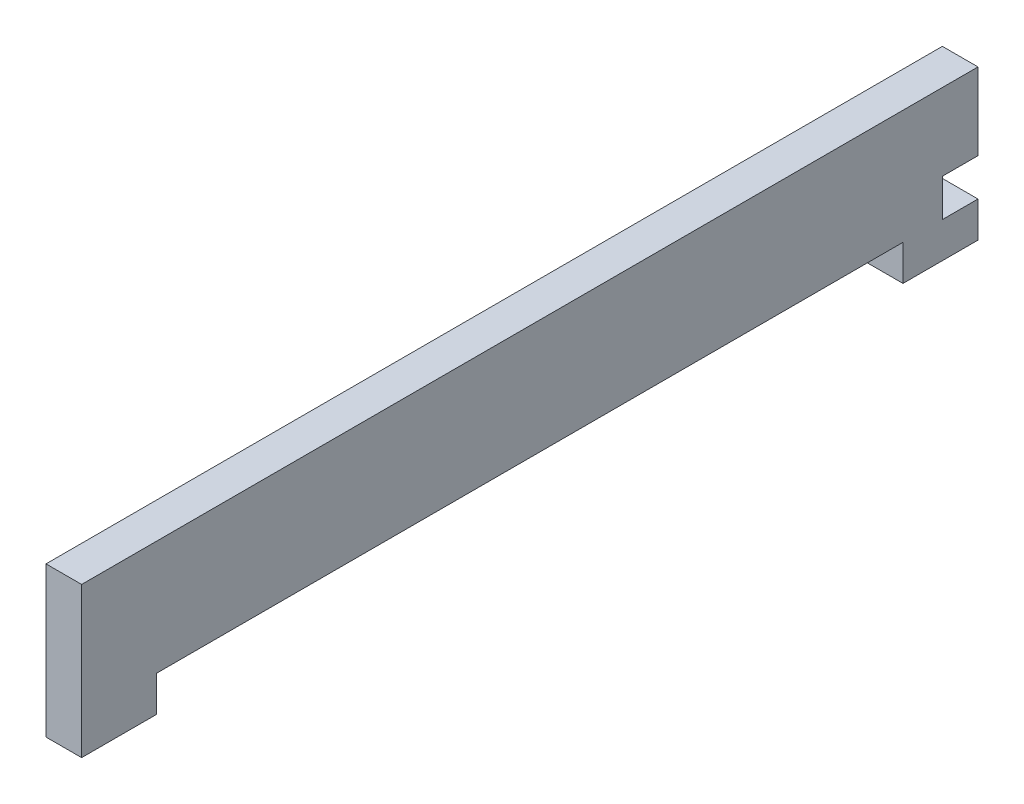
ISO-10303-21;
HEADER;
FILE_DESCRIPTION(('STEP AP214'),'2;1');
FILE_NAME('part.step','',(''),(''),'','','');
FILE_SCHEMA(('AUTOMOTIVE_DESIGN { 1 0 10303 214 1 1 1 1 }'));
ENDSEC;
DATA;
#1=APPLICATION_CONTEXT('core data for automotive mechanical design processes');
#2=APPLICATION_PROTOCOL_DEFINITION('international standard','automotive_design',2000,#1);
#3=PRODUCT_CONTEXT('',#1,'mechanical');
#4=PRODUCT('Part','Part','',(#3));
#5=PRODUCT_RELATED_PRODUCT_CATEGORY('part','',(#4));
#6=PRODUCT_DEFINITION_FORMATION('','',#4);
#7=PRODUCT_DEFINITION_CONTEXT('part definition',#1,'design');
#8=PRODUCT_DEFINITION('design','',#6,#7);
#9=PRODUCT_DEFINITION_SHAPE('','',#8);
#10=(LENGTH_UNIT() NAMED_UNIT(*) SI_UNIT(.MILLI.,.METRE.));
#11=(NAMED_UNIT(*) PLANE_ANGLE_UNIT() SI_UNIT($,.RADIAN.));
#12=(NAMED_UNIT(*) SI_UNIT($,.STERADIAN.) SOLID_ANGLE_UNIT());
#13=UNCERTAINTY_MEASURE_WITH_UNIT(LENGTH_MEASURE(1.E-05),#10,'distance_accuracy_value','');
#14=(GEOMETRIC_REPRESENTATION_CONTEXT(3) GLOBAL_UNCERTAINTY_ASSIGNED_CONTEXT((#13)) GLOBAL_UNIT_ASSIGNED_CONTEXT((#10,
#11,#12)) REPRESENTATION_CONTEXT('',''));
#15=CARTESIAN_POINT('',(0.,0.,0.));
#16=DIRECTION('',(0.,0.,1.));
#17=DIRECTION('',(1.,0.,0.));
#18=AXIS2_PLACEMENT_3D('',#15,#16,#17);
#19=CARTESIAN_POINT('',(4.75,0.,-119.5));
#20=DIRECTION('',(0.,0.,1.));
#21=DIRECTION('',(1.,0.,0.));
#22=AXIS2_PLACEMENT_3D('',#19,#20,#21);
#23=PLANE('',#22);
#24=DIRECTION('',(0.,1.,0.));
#25=VECTOR('',#24,1.);
#26=CARTESIAN_POINT('',(0.,0.,-119.5));
#27=LINE('',#26,#25);
#28=CARTESIAN_POINT('',(0.,0.,-119.5));
#29=VERTEX_POINT('',#28);
#30=CARTESIAN_POINT('',(0.,4.75,-119.5));
#31=VERTEX_POINT('',#30);
#32=EDGE_CURVE('E160',#29,#31,#27,.T.);
#33=ORIENTED_EDGE('',*,*,#32,.T.);
#34=DIRECTION('',(1.,0.,0.));
#35=VECTOR('',#34,1.);
#36=CARTESIAN_POINT('',(0.,4.75,-119.5));
#37=LINE('',#36,#35);
#38=CARTESIAN_POINT('',(4.75,4.75,-119.5));
#39=VERTEX_POINT('',#38);
#40=EDGE_CURVE('E141',#31,#39,#37,.T.);
#41=ORIENTED_EDGE('',*,*,#40,.T.);
#42=DIRECTION('',(0.,1.,0.));
#43=VECTOR('',#42,1.);
#44=CARTESIAN_POINT('',(4.75,0.,-119.5));
#45=LINE('',#44,#43);
#46=CARTESIAN_POINT('',(4.75,0.,-119.5));
#47=VERTEX_POINT('',#46);
#48=EDGE_CURVE('E120',#47,#39,#45,.T.);
#49=ORIENTED_EDGE('',*,*,#48,.F.);
#50=DIRECTION('',(-1.,0.,0.));
#51=VECTOR('',#50,1.);
#52=CARTESIAN_POINT('',(4.75,0.,-119.5));
#53=LINE('',#52,#51);
#54=EDGE_CURVE('E129',#47,#29,#53,.T.);
#55=ORIENTED_EDGE('',*,*,#54,.T.);
#56=EDGE_LOOP('',(#33,#41,#49,#55));
#57=FACE_BOUND('',#56,.T.);
#58=ADVANCED_FACE('F33',(#57),#23,.F.);
#59=CARTESIAN_POINT('',(4.75,0.,0.));
#60=DIRECTION('',(0.,0.,-1.));
#61=DIRECTION('',(-1.,0.,0.));
#62=AXIS2_PLACEMENT_3D('',#59,#60,#61);
#63=PLANE('',#62);
#64=DIRECTION('',(0.,-1.,0.));
#65=VECTOR('',#64,1.);
#66=CARTESIAN_POINT('',(0.,0.,0.));
#67=LINE('',#66,#65);
#68=CARTESIAN_POINT('',(0.,20.,0.));
#69=VERTEX_POINT('',#68);
#70=CARTESIAN_POINT('',(0.,0.,0.));
#71=VERTEX_POINT('',#70);
#72=EDGE_CURVE('E147',#69,#71,#67,.T.);
#73=ORIENTED_EDGE('',*,*,#72,.T.);
#74=DIRECTION('',(-1.,0.,0.));
#75=VECTOR('',#74,1.);
#76=CARTESIAN_POINT('',(4.75,0.,0.));
#77=LINE('',#76,#75);
#78=CARTESIAN_POINT('',(4.75,0.,0.));
#79=VERTEX_POINT('',#78);
#80=EDGE_CURVE('E11',#79,#71,#77,.T.);
#81=ORIENTED_EDGE('',*,*,#80,.F.);
#82=DIRECTION('',(0.,-1.,0.));
#83=VECTOR('',#82,1.);
#84=CARTESIAN_POINT('',(4.75,0.,0.));
#85=LINE('',#84,#83);
#86=CARTESIAN_POINT('',(4.75,20.,0.));
#87=VERTEX_POINT('',#86);
#88=EDGE_CURVE('E163',#87,#79,#85,.T.);
#89=ORIENTED_EDGE('',*,*,#88,.F.);
#90=DIRECTION('',(-1.,0.,0.));
#91=VECTOR('',#90,1.);
#92=CARTESIAN_POINT('',(4.75,20.,0.));
#93=LINE('',#92,#91);
#94=EDGE_CURVE('E143',#87,#69,#93,.T.);
#95=ORIENTED_EDGE('',*,*,#94,.T.);
#96=EDGE_LOOP('',(#73,#81,#89,#95));
#97=FACE_BOUND('',#96,.T.);
#98=ADVANCED_FACE('F35',(#97),#63,.F.);
#99=CARTESIAN_POINT('',(4.75,0.,0.));
#100=DIRECTION('',(0.,1.,0.));
#101=DIRECTION('',(0.,0.,1.));
#102=AXIS2_PLACEMENT_3D('',#99,#100,#101);
#103=PLANE('',#102);
#104=DIRECTION('',(0.,0.,-1.));
#105=VECTOR('',#104,1.);
#106=CARTESIAN_POINT('',(0.,0.,0.));
#107=LINE('',#106,#105);
#108=CARTESIAN_POINT('',(0.,0.,-10.));
#109=VERTEX_POINT('',#108);
#110=EDGE_CURVE('E150',#71,#109,#107,.T.);
#111=ORIENTED_EDGE('',*,*,#110,.T.);
#112=DIRECTION('',(-1.,0.,0.));
#113=VECTOR('',#112,1.);
#114=CARTESIAN_POINT('',(4.75,0.,-10.));
#115=LINE('',#114,#113);
#116=CARTESIAN_POINT('',(4.75,0.,-10.));
#117=VERTEX_POINT('',#116);
#118=EDGE_CURVE('E41',#117,#109,#115,.T.);
#119=ORIENTED_EDGE('',*,*,#118,.F.);
#120=DIRECTION('',(0.,0.,-1.));
#121=VECTOR('',#120,1.);
#122=CARTESIAN_POINT('',(4.75,0.,0.));
#123=LINE('',#122,#121);
#124=EDGE_CURVE('E98',#79,#117,#123,.T.);
#125=ORIENTED_EDGE('',*,*,#124,.F.);
#126=ORIENTED_EDGE('',*,*,#80,.T.);
#127=EDGE_LOOP('',(#111,#119,#125,#126));
#128=FACE_BOUND('',#127,.T.);
#129=ADVANCED_FACE('F258',(#128),#103,.F.);
#130=CARTESIAN_POINT('',(4.75,0.,-10.));
#131=DIRECTION('',(0.,0.,1.));
#132=DIRECTION('',(1.,0.,0.));
#133=AXIS2_PLACEMENT_3D('',#130,#131,#132);
#134=PLANE('',#133);
#135=DIRECTION('',(0.,1.,0.));
#136=VECTOR('',#135,1.);
#137=CARTESIAN_POINT('',(0.,0.,-10.));
#138=LINE('',#137,#136);
#139=CARTESIAN_POINT('',(0.,4.75,-10.));
#140=VERTEX_POINT('',#139);
#141=EDGE_CURVE('E152',#109,#140,#138,.T.);
#142=ORIENTED_EDGE('',*,*,#141,.T.);
#143=DIRECTION('',(-1.,0.,0.));
#144=VECTOR('',#143,1.);
#145=CARTESIAN_POINT('',(4.75,4.75,-10.));
#146=LINE('',#145,#144);
#147=CARTESIAN_POINT('',(4.75,4.75,-10.));
#148=VERTEX_POINT('',#147);
#149=EDGE_CURVE('E170',#148,#140,#146,.T.);
#150=ORIENTED_EDGE('',*,*,#149,.F.);
#151=DIRECTION('',(0.,1.,0.));
#152=VECTOR('',#151,1.);
#153=CARTESIAN_POINT('',(4.75,0.,-10.));
#154=LINE('',#153,#152);
#155=EDGE_CURVE('E178',#117,#148,#154,.T.);
#156=ORIENTED_EDGE('',*,*,#155,.F.);
#157=ORIENTED_EDGE('',*,*,#118,.T.);
#158=EDGE_LOOP('',(#142,#150,#156,#157));
#159=FACE_BOUND('',#158,.T.);
#160=ADVANCED_FACE('F176',(#159),#134,.F.);
#161=CARTESIAN_POINT('',(4.75,4.75,-10.));
#162=DIRECTION('',(0.,1.,0.));
#163=DIRECTION('',(0.,0.,1.));
#164=AXIS2_PLACEMENT_3D('',#161,#162,#163);
#165=PLANE('',#164);
#166=DIRECTION('',(0.,0.,-1.));
#167=VECTOR('',#166,1.);
#168=CARTESIAN_POINT('',(0.,4.75,-10.));
#169=LINE('',#168,#167);
#170=CARTESIAN_POINT('',(0.,4.75,-109.5));
#171=VERTEX_POINT('',#170);
#172=EDGE_CURVE('E154',#140,#171,#169,.T.);
#173=ORIENTED_EDGE('',*,*,#172,.T.);
#174=DIRECTION('',(-1.,0.,0.));
#175=VECTOR('',#174,1.);
#176=CARTESIAN_POINT('',(4.75,4.75,-109.5));
#177=LINE('',#176,#175);
#178=CARTESIAN_POINT('',(4.75,4.75,-109.5));
#179=VERTEX_POINT('',#178);
#180=EDGE_CURVE('E167',#179,#171,#177,.T.);
#181=ORIENTED_EDGE('',*,*,#180,.F.);
#182=DIRECTION('',(0.,0.,-1.));
#183=VECTOR('',#182,1.);
#184=CARTESIAN_POINT('',(4.75,4.75,-10.));
#185=LINE('',#184,#183);
#186=EDGE_CURVE('E191',#148,#179,#185,.T.);
#187=ORIENTED_EDGE('',*,*,#186,.F.);
#188=ORIENTED_EDGE('',*,*,#149,.T.);
#189=EDGE_LOOP('',(#173,#181,#187,#188));
#190=FACE_BOUND('',#189,.T.);
#191=ADVANCED_FACE('F187',(#190),#165,.F.);
#192=CARTESIAN_POINT('',(4.75,0.,-109.5));
#193=DIRECTION('',(0.,0.,-1.));
#194=DIRECTION('',(-1.,0.,0.));
#195=AXIS2_PLACEMENT_3D('',#192,#193,#194);
#196=PLANE('',#195);
#197=DIRECTION('',(0.,-1.,0.));
#198=VECTOR('',#197,1.);
#199=CARTESIAN_POINT('',(0.,0.,-109.5));
#200=LINE('',#199,#198);
#201=CARTESIAN_POINT('',(0.,0.,-109.5));
#202=VERTEX_POINT('',#201);
#203=EDGE_CURVE('E156',#171,#202,#200,.T.);
#204=ORIENTED_EDGE('',*,*,#203,.T.);
#205=DIRECTION('',(-1.,0.,0.));
#206=VECTOR('',#205,1.);
#207=CARTESIAN_POINT('',(4.75,0.,-109.5));
#208=LINE('',#207,#206);
#209=CARTESIAN_POINT('',(4.75,0.,-109.5));
#210=VERTEX_POINT('',#209);
#211=EDGE_CURVE('E136',#210,#202,#208,.T.);
#212=ORIENTED_EDGE('',*,*,#211,.F.);
#213=DIRECTION('',(0.,-1.,0.));
#214=VECTOR('',#213,1.);
#215=CARTESIAN_POINT('',(4.75,0.,-109.5));
#216=LINE('',#215,#214);
#217=EDGE_CURVE('E122',#179,#210,#216,.T.);
#218=ORIENTED_EDGE('',*,*,#217,.F.);
#219=ORIENTED_EDGE('',*,*,#180,.T.);
#220=EDGE_LOOP('',(#204,#212,#218,#219));
#221=FACE_BOUND('',#220,.T.);
#222=ADVANCED_FACE('F190',(#221),#196,.F.);
#223=CARTESIAN_POINT('',(4.75,0.,-109.5));
#224=DIRECTION('',(0.,1.,0.));
#225=DIRECTION('',(0.,0.,1.));
#226=AXIS2_PLACEMENT_3D('',#223,#224,#225);
#227=PLANE('',#226);
#228=DIRECTION('',(0.,0.,-1.));
#229=VECTOR('',#228,1.);
#230=CARTESIAN_POINT('',(0.,0.,-109.5));
#231=LINE('',#230,#229);
#232=EDGE_CURVE('E132',#202,#29,#231,.T.);
#233=ORIENTED_EDGE('',*,*,#232,.T.);
#234=ORIENTED_EDGE('',*,*,#54,.F.);
#235=DIRECTION('',(0.,0.,-1.));
#236=VECTOR('',#235,1.);
#237=CARTESIAN_POINT('',(4.75,0.,-109.5));
#238=LINE('',#237,#236);
#239=EDGE_CURVE('E115',#210,#47,#238,.T.);
#240=ORIENTED_EDGE('',*,*,#239,.F.);
#241=ORIENTED_EDGE('',*,*,#211,.T.);
#242=EDGE_LOOP('',(#233,#234,#240,#241));
#243=FACE_BOUND('',#242,.T.);
#244=ADVANCED_FACE('F130',(#243),#227,.F.);
#245=CARTESIAN_POINT('',(4.75,9.75,-119.5));
#246=VERTEX_POINT('',#245);
#247=CARTESIAN_POINT('',(4.75,20.,-119.5));
#248=VERTEX_POINT('',#247);
#249=EDGE_CURVE('E126',#246,#248,#45,.T.);
#250=ORIENTED_EDGE('',*,*,#249,.F.);
#251=DIRECTION('',(1.,0.,0.));
#252=VECTOR('',#251,1.);
#253=CARTESIAN_POINT('',(0.,9.75,-119.5));
#254=LINE('',#253,#252);
#255=CARTESIAN_POINT('',(0.,9.75,-119.5));
#256=VERTEX_POINT('',#255);
#257=EDGE_CURVE('E197',#256,#246,#254,.T.);
#258=ORIENTED_EDGE('',*,*,#257,.F.);
#259=CARTESIAN_POINT('',(0.,20.,-119.5));
#260=VERTEX_POINT('',#259);
#261=EDGE_CURVE('E159',#256,#260,#27,.T.);
#262=ORIENTED_EDGE('',*,*,#261,.T.);
#263=DIRECTION('',(-1.,0.,0.));
#264=VECTOR('',#263,1.);
#265=CARTESIAN_POINT('',(4.75,20.,-119.5));
#266=LINE('',#265,#264);
#267=EDGE_CURVE('E137',#248,#260,#266,.T.);
#268=ORIENTED_EDGE('',*,*,#267,.F.);
#269=EDGE_LOOP('',(#250,#258,#262,#268));
#270=FACE_BOUND('',#269,.T.);
#271=ADVANCED_FACE('F232',(#270),#23,.F.);
#272=CARTESIAN_POINT('',(4.75,20.,0.));
#273=DIRECTION('',(0.,-1.,0.));
#274=DIRECTION('',(0.,0.,-1.));
#275=AXIS2_PLACEMENT_3D('',#272,#273,#274);
#276=PLANE('',#275);
#277=DIRECTION('',(0.,0.,1.));
#278=VECTOR('',#277,1.);
#279=CARTESIAN_POINT('',(0.,20.,0.));
#280=LINE('',#279,#278);
#281=EDGE_CURVE('E90',#260,#69,#280,.T.);
#282=ORIENTED_EDGE('',*,*,#281,.T.);
#283=ORIENTED_EDGE('',*,*,#94,.F.);
#284=DIRECTION('',(0.,0.,1.));
#285=VECTOR('',#284,1.);
#286=CARTESIAN_POINT('',(4.75,20.,0.));
#287=LINE('',#286,#285);
#288=EDGE_CURVE('E57',#248,#87,#287,.T.);
#289=ORIENTED_EDGE('',*,*,#288,.F.);
#290=ORIENTED_EDGE('',*,*,#267,.T.);
#291=EDGE_LOOP('',(#282,#283,#289,#290));
#292=FACE_BOUND('',#291,.T.);
#293=ADVANCED_FACE('F263',(#292),#276,.F.);
#294=CARTESIAN_POINT('',(4.75,0.,0.));
#295=DIRECTION('',(-1.,0.,0.));
#296=DIRECTION('',(0.,0.,1.));
#297=AXIS2_PLACEMENT_3D('',#294,#295,#296);
#298=PLANE('',#297);
#299=ORIENTED_EDGE('',*,*,#48,.T.);
#300=DIRECTION('',(0.,0.,-1.));
#301=VECTOR('',#300,1.);
#302=CARTESIAN_POINT('',(4.75,4.75,-119.5));
#303=LINE('',#302,#301);
#304=CARTESIAN_POINT('',(4.75,4.75,-114.75));
#305=VERTEX_POINT('',#304);
#306=EDGE_CURVE('E207',#305,#39,#303,.T.);
#307=ORIENTED_EDGE('',*,*,#306,.F.);
#308=DIRECTION('',(0.,-1.,0.));
#309=VECTOR('',#308,1.);
#310=CARTESIAN_POINT('',(4.75,4.75,-114.75));
#311=LINE('',#310,#309);
#312=CARTESIAN_POINT('',(4.75,9.75,-114.75));
#313=VERTEX_POINT('',#312);
#314=EDGE_CURVE('E211',#313,#305,#311,.T.);
#315=ORIENTED_EDGE('',*,*,#314,.F.);
#316=DIRECTION('',(0.,0.,1.));
#317=VECTOR('',#316,1.);
#318=CARTESIAN_POINT('',(4.75,9.75,-119.5));
#319=LINE('',#318,#317);
#320=EDGE_CURVE('E214',#246,#313,#319,.T.);
#321=ORIENTED_EDGE('',*,*,#320,.F.);
#322=ORIENTED_EDGE('',*,*,#249,.T.);
#323=ORIENTED_EDGE('',*,*,#288,.T.);
#324=ORIENTED_EDGE('',*,*,#88,.T.);
#325=ORIENTED_EDGE('',*,*,#124,.T.);
#326=ORIENTED_EDGE('',*,*,#155,.T.);
#327=ORIENTED_EDGE('',*,*,#186,.T.);
#328=ORIENTED_EDGE('',*,*,#217,.T.);
#329=ORIENTED_EDGE('',*,*,#239,.T.);
#330=EDGE_LOOP('',(#299,#307,#315,#321,#322,#323,#324,#325,#326,#327,#328,#329));
#331=FACE_BOUND('',#330,.T.);
#332=ADVANCED_FACE('F117',(#331),#298,.F.);
#333=CARTESIAN_POINT('',(0.,0.,0.));
#334=DIRECTION('',(-1.,0.,0.));
#335=DIRECTION('',(0.,0.,1.));
#336=AXIS2_PLACEMENT_3D('',#333,#334,#335);
#337=PLANE('',#336);
#338=DIRECTION('',(0.,0.,-1.));
#339=VECTOR('',#338,1.);
#340=CARTESIAN_POINT('',(0.,4.75,-119.5));
#341=LINE('',#340,#339);
#342=CARTESIAN_POINT('',(0.,4.75,-114.75));
#343=VERTEX_POINT('',#342);
#344=EDGE_CURVE('E201',#343,#31,#341,.T.);
#345=ORIENTED_EDGE('',*,*,#344,.T.);
#346=ORIENTED_EDGE('',*,*,#32,.F.);
#347=ORIENTED_EDGE('',*,*,#232,.F.);
#348=ORIENTED_EDGE('',*,*,#203,.F.);
#349=ORIENTED_EDGE('',*,*,#172,.F.);
#350=ORIENTED_EDGE('',*,*,#141,.F.);
#351=ORIENTED_EDGE('',*,*,#110,.F.);
#352=ORIENTED_EDGE('',*,*,#72,.F.);
#353=ORIENTED_EDGE('',*,*,#281,.F.);
#354=ORIENTED_EDGE('',*,*,#261,.F.);
#355=DIRECTION('',(0.,0.,1.));
#356=VECTOR('',#355,1.);
#357=CARTESIAN_POINT('',(0.,9.75,-119.5));
#358=LINE('',#357,#356);
#359=CARTESIAN_POINT('',(0.,9.75,-114.75));
#360=VERTEX_POINT('',#359);
#361=EDGE_CURVE('E210',#256,#360,#358,.T.);
#362=ORIENTED_EDGE('',*,*,#361,.T.);
#363=DIRECTION('',(0.,-1.,0.));
#364=VECTOR('',#363,1.);
#365=CARTESIAN_POINT('',(0.,4.75,-114.75));
#366=LINE('',#365,#364);
#367=EDGE_CURVE('E48',#360,#343,#366,.T.);
#368=ORIENTED_EDGE('',*,*,#367,.T.);
#369=EDGE_LOOP('',(#345,#346,#347,#348,#349,#350,#351,#352,#353,#354,#362,#368));
#370=FACE_BOUND('',#369,.T.);
#371=ADVANCED_FACE('F182',(#370),#337,.T.);
#372=CARTESIAN_POINT('',(0.,4.75,-119.5));
#373=DIRECTION('',(0.,-1.,0.));
#374=DIRECTION('',(0.,0.,-1.));
#375=AXIS2_PLACEMENT_3D('',#372,#373,#374);
#376=PLANE('',#375);
#377=ORIENTED_EDGE('',*,*,#306,.T.);
#378=ORIENTED_EDGE('',*,*,#40,.F.);
#379=ORIENTED_EDGE('',*,*,#344,.F.);
#380=DIRECTION('',(1.,0.,0.));
#381=VECTOR('',#380,1.);
#382=CARTESIAN_POINT('',(0.,4.75,-114.75));
#383=LINE('',#382,#381);
#384=EDGE_CURVE('E203',#343,#305,#383,.T.);
#385=ORIENTED_EDGE('',*,*,#384,.T.);
#386=EDGE_LOOP('',(#377,#378,#379,#385));
#387=FACE_BOUND('',#386,.T.);
#388=ADVANCED_FACE('F244',(#387),#376,.F.);
#389=CARTESIAN_POINT('',(0.,4.75,-114.75));
#390=DIRECTION('',(0.,0.,1.));
#391=DIRECTION('',(1.,0.,0.));
#392=AXIS2_PLACEMENT_3D('',#389,#390,#391);
#393=PLANE('',#392);
#394=ORIENTED_EDGE('',*,*,#314,.T.);
#395=ORIENTED_EDGE('',*,*,#384,.F.);
#396=ORIENTED_EDGE('',*,*,#367,.F.);
#397=DIRECTION('',(1.,0.,0.));
#398=VECTOR('',#397,1.);
#399=CARTESIAN_POINT('',(0.,9.75,-114.75));
#400=LINE('',#399,#398);
#401=EDGE_CURVE('E200',#360,#313,#400,.T.);
#402=ORIENTED_EDGE('',*,*,#401,.T.);
#403=EDGE_LOOP('',(#394,#395,#396,#402));
#404=FACE_BOUND('',#403,.T.);
#405=ADVANCED_FACE('F242',(#404),#393,.F.);
#406=CARTESIAN_POINT('',(0.,9.75,-119.5));
#407=DIRECTION('',(0.,1.,0.));
#408=DIRECTION('',(0.,0.,1.));
#409=AXIS2_PLACEMENT_3D('',#406,#407,#408);
#410=PLANE('',#409);
#411=ORIENTED_EDGE('',*,*,#320,.T.);
#412=ORIENTED_EDGE('',*,*,#401,.F.);
#413=ORIENTED_EDGE('',*,*,#361,.F.);
#414=ORIENTED_EDGE('',*,*,#257,.T.);
#415=EDGE_LOOP('',(#411,#412,#413,#414));
#416=FACE_BOUND('',#415,.T.);
#417=ADVANCED_FACE('F226',(#416),#410,.F.);
#418=CLOSED_SHELL('',(#58,#98,#129,#160,#191,#222,#244,#271,#293,#332,#371,#388,#405,#417));
#419=MANIFOLD_SOLID_BREP('B2',#418);
#420=ADVANCED_BREP_SHAPE_REPRESENTATION('',(#18,#419),#14);
#421=SHAPE_DEFINITION_REPRESENTATION(#9,#420);
ENDSEC;
END-ISO-10303-21;
